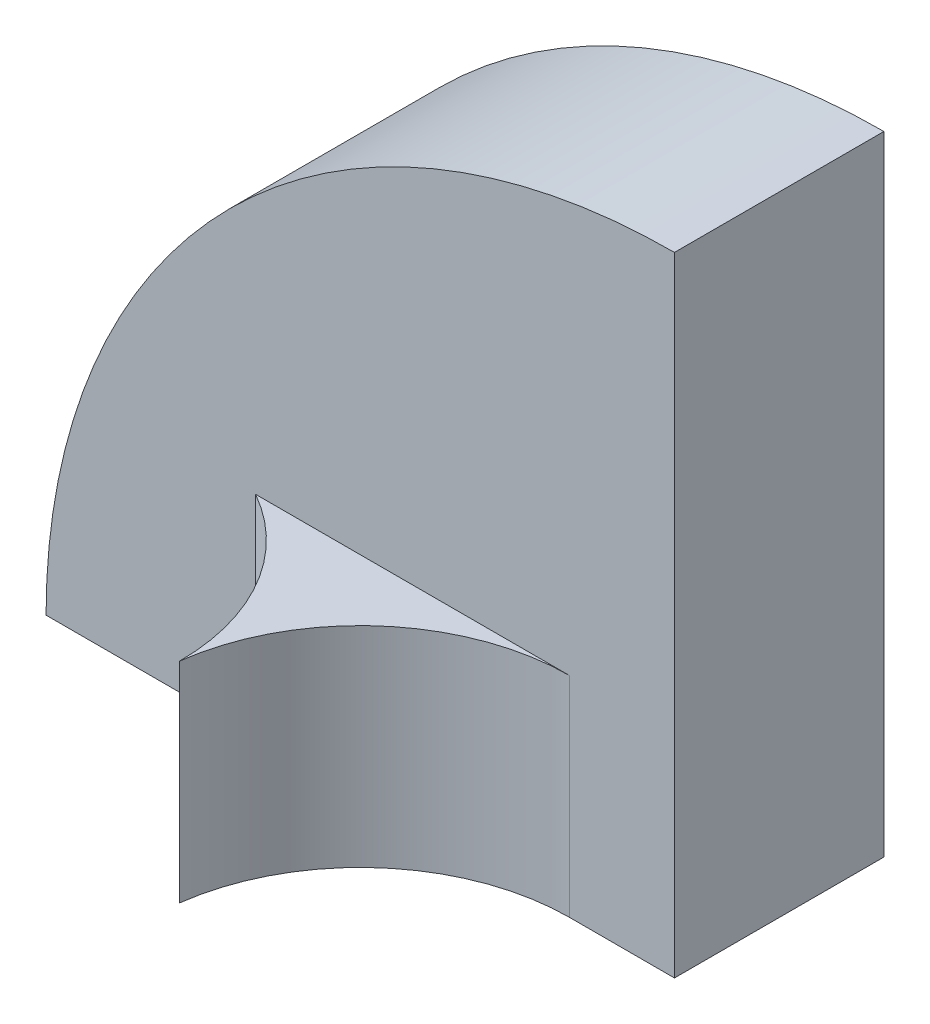
ISO-10303-21;
HEADER;
FILE_DESCRIPTION(('STEP AP214'),'2;1');
FILE_NAME('part.step','',(''),(''),'','','');
FILE_SCHEMA(('AUTOMOTIVE_DESIGN { 1 0 10303 214 1 1 1 1 }'));
ENDSEC;
DATA;
#1=APPLICATION_CONTEXT('core data for automotive mechanical design processes');
#2=APPLICATION_PROTOCOL_DEFINITION('international standard','automotive_design',2000,#1);
#3=PRODUCT_CONTEXT('',#1,'mechanical');
#4=PRODUCT('Part','Part','',(#3));
#5=PRODUCT_RELATED_PRODUCT_CATEGORY('part','',(#4));
#6=PRODUCT_DEFINITION_FORMATION('','',#4);
#7=PRODUCT_DEFINITION_CONTEXT('part definition',#1,'design');
#8=PRODUCT_DEFINITION('design','',#6,#7);
#9=PRODUCT_DEFINITION_SHAPE('','',#8);
#10=(LENGTH_UNIT() NAMED_UNIT(*) SI_UNIT(.MILLI.,.METRE.));
#11=(NAMED_UNIT(*) PLANE_ANGLE_UNIT() SI_UNIT($,.RADIAN.));
#12=(NAMED_UNIT(*) SI_UNIT($,.STERADIAN.) SOLID_ANGLE_UNIT());
#13=UNCERTAINTY_MEASURE_WITH_UNIT(LENGTH_MEASURE(1.E-05),#10,'distance_accuracy_value','');
#14=(GEOMETRIC_REPRESENTATION_CONTEXT(3) GLOBAL_UNCERTAINTY_ASSIGNED_CONTEXT((#13)) GLOBAL_UNIT_ASSIGNED_CONTEXT((#10,
#11,#12)) REPRESENTATION_CONTEXT('',''));
#15=CARTESIAN_POINT('',(0.,0.,0.));
#16=DIRECTION('',(0.,0.,1.));
#17=DIRECTION('',(1.,0.,0.));
#18=AXIS2_PLACEMENT_3D('',#15,#16,#17);
#19=CARTESIAN_POINT('',(0.,0.,2.));
#20=DIRECTION('',(0.,0.,-1.));
#21=DIRECTION('',(-1.,0.,0.));
#22=AXIS2_PLACEMENT_3D('',#19,#20,#21);
#23=PLANE('',#22);
#24=DIRECTION('',(0.,-1.,0.));
#25=VECTOR('',#24,1.);
#26=CARTESIAN_POINT('',(-3.99996614209211,2.,2.));
#27=LINE('',#26,#25);
#28=CARTESIAN_POINT('',(-3.99996614209211,2.,2.));
#29=VERTEX_POINT('',#28);
#30=CARTESIAN_POINT('',(-3.99996614209211,0.,2.));
#31=VERTEX_POINT('',#30);
#32=EDGE_CURVE('E107',#29,#31,#27,.T.);
#33=ORIENTED_EDGE('',*,*,#32,.F.);
#34=DIRECTION('',(-1.,0.,0.));
#35=VECTOR('',#34,1.);
#36=CARTESIAN_POINT('',(0.,2.,2.));
#37=LINE('',#36,#35);
#38=CARTESIAN_POINT('',(-1.00003385790789,2.,2.));
#39=VERTEX_POINT('',#38);
#40=EDGE_CURVE('E108',#39,#29,#37,.T.);
#41=ORIENTED_EDGE('',*,*,#40,.F.);
#42=DIRECTION('',(0.,-1.,0.));
#43=VECTOR('',#42,1.);
#44=CARTESIAN_POINT('',(-1.00003385790789,2.,2.));
#45=LINE('',#44,#43);
#46=CARTESIAN_POINT('',(-1.00003385790789,0.,2.));
#47=VERTEX_POINT('',#46);
#48=EDGE_CURVE('E117',#39,#47,#45,.T.);
#49=ORIENTED_EDGE('',*,*,#48,.T.);
#50=DIRECTION('',(1.,0.,0.));
#51=VECTOR('',#50,1.);
#52=CARTESIAN_POINT('',(0.,0.,2.));
#53=LINE('',#52,#51);
#54=CARTESIAN_POINT('',(0.,0.,2.));
#55=VERTEX_POINT('',#54);
#56=EDGE_CURVE('E82',#47,#55,#53,.T.);
#57=ORIENTED_EDGE('',*,*,#56,.T.);
#58=DIRECTION('',(0.,1.,0.));
#59=VECTOR('',#58,1.);
#60=CARTESIAN_POINT('',(0.,0.,2.));
#61=LINE('',#60,#59);
#62=CARTESIAN_POINT('',(0.,6.,2.));
#63=VERTEX_POINT('',#62);
#64=EDGE_CURVE('E135',#55,#63,#61,.T.);
#65=ORIENTED_EDGE('',*,*,#64,.T.);
#66=CARTESIAN_POINT('',(0.,0.,2.));
#67=DIRECTION('',(0.,0.,1.));
#68=DIRECTION('',(-1.,0.,0.));
#69=AXIS2_PLACEMENT_3D('',#66,#67,#68);
#70=CIRCLE('',#69,6.);
#71=CARTESIAN_POINT('',(-6.,0.,2.));
#72=VERTEX_POINT('',#71);
#73=EDGE_CURVE('E61',#63,#72,#70,.T.);
#74=ORIENTED_EDGE('',*,*,#73,.T.);
#75=EDGE_CURVE('E134',#72,#31,#53,.T.);
#76=ORIENTED_EDGE('',*,*,#75,.T.);
#77=EDGE_LOOP('',(#33,#41,#49,#57,#65,#74,#76));
#78=FACE_BOUND('',#77,.T.);
#79=ADVANCED_FACE('F35',(#78),#23,.F.);
#80=CARTESIAN_POINT('',(0.,0.,2.));
#81=DIRECTION('',(0.,1.,0.));
#82=DIRECTION('',(-1.,0.,0.));
#83=AXIS2_PLACEMENT_3D('',#80,#81,#82);
#84=PLANE('',#83);
#85=DIRECTION('',(1.,0.,0.));
#86=VECTOR('',#85,1.);
#87=CARTESIAN_POINT('',(0.,0.,0.));
#88=LINE('',#87,#86);
#89=CARTESIAN_POINT('',(-6.,0.,0.));
#90=VERTEX_POINT('',#89);
#91=CARTESIAN_POINT('',(0.,0.,0.));
#92=VERTEX_POINT('',#91);
#93=EDGE_CURVE('E126',#90,#92,#88,.T.);
#94=ORIENTED_EDGE('',*,*,#93,.T.);
#95=DIRECTION('',(0.,0.,-1.));
#96=VECTOR('',#95,1.);
#97=CARTESIAN_POINT('',(0.,0.,2.));
#98=LINE('',#97,#96);
#99=EDGE_CURVE('E11',#55,#92,#98,.T.);
#100=ORIENTED_EDGE('',*,*,#99,.F.);
#101=ORIENTED_EDGE('',*,*,#56,.F.);
#102=CARTESIAN_POINT('',(-1.,0.,3.99999999971341));
#103=DIRECTION('',(0.,-1.,0.));
#104=DIRECTION('',(1.,0.,0.));
#105=AXIS2_PLACEMENT_3D('',#102,#103,#104);
#106=CIRCLE('',#105,2.);
#107=CARTESIAN_POINT('',(-2.98323737762175,0.,3.74160204305741));
#108=VERTEX_POINT('',#107);
#109=EDGE_CURVE('E52',#47,#108,#106,.F.);
#110=ORIENTED_EDGE('',*,*,#109,.T.);
#111=CARTESIAN_POINT('',(-4.98323737762175,0.,3.74160204334401));
#112=DIRECTION('',(0.,-1.,0.));
#113=DIRECTION('',(1.,0.,0.));
#114=AXIS2_PLACEMENT_3D('',#111,#112,#113);
#115=CIRCLE('',#114,2.);
#116=EDGE_CURVE('E105',#108,#31,#115,.F.);
#117=ORIENTED_EDGE('',*,*,#116,.T.);
#118=ORIENTED_EDGE('',*,*,#75,.F.);
#119=DIRECTION('',(0.,0.,-1.));
#120=VECTOR('',#119,1.);
#121=CARTESIAN_POINT('',(-6.,0.,2.));
#122=LINE('',#121,#120);
#123=EDGE_CURVE('E144',#72,#90,#122,.T.);
#124=ORIENTED_EDGE('',*,*,#123,.T.);
#125=EDGE_LOOP('',(#94,#100,#101,#110,#117,#118,#124));
#126=FACE_BOUND('',#125,.T.);
#127=ADVANCED_FACE('F37',(#126),#84,.F.);
#128=CARTESIAN_POINT('',(0.,0.,2.));
#129=DIRECTION('',(-1.,0.,0.));
#130=DIRECTION('',(0.,0.,1.));
#131=AXIS2_PLACEMENT_3D('',#128,#129,#130);
#132=PLANE('',#131);
#133=DIRECTION('',(0.,1.,0.));
#134=VECTOR('',#133,1.);
#135=CARTESIAN_POINT('',(0.,0.,0.));
#136=LINE('',#135,#134);
#137=CARTESIAN_POINT('',(0.,6.,0.));
#138=VERTEX_POINT('',#137);
#139=EDGE_CURVE('E146',#92,#138,#136,.T.);
#140=ORIENTED_EDGE('',*,*,#139,.T.);
#141=DIRECTION('',(0.,0.,-1.));
#142=VECTOR('',#141,1.);
#143=CARTESIAN_POINT('',(0.,6.,2.));
#144=LINE('',#143,#142);
#145=EDGE_CURVE('E44',#63,#138,#144,.T.);
#146=ORIENTED_EDGE('',*,*,#145,.F.);
#147=ORIENTED_EDGE('',*,*,#64,.F.);
#148=ORIENTED_EDGE('',*,*,#99,.T.);
#149=EDGE_LOOP('',(#140,#146,#147,#148));
#150=FACE_BOUND('',#149,.T.);
#151=ADVANCED_FACE('F156',(#150),#132,.F.);
#152=CARTESIAN_POINT('',(0.,0.,2.));
#153=DIRECTION('',(0.,0.,-1.));
#154=DIRECTION('',(-1.,0.,0.));
#155=AXIS2_PLACEMENT_3D('',#152,#153,#154);
#156=CYLINDRICAL_SURFACE('',#155,6.);
#157=CARTESIAN_POINT('',(0.,0.,0.));
#158=DIRECTION('',(0.,0.,1.));
#159=DIRECTION('',(-1.,0.,0.));
#160=AXIS2_PLACEMENT_3D('',#157,#158,#159);
#161=CIRCLE('',#160,6.);
#162=EDGE_CURVE('E78',#138,#90,#161,.T.);
#163=ORIENTED_EDGE('',*,*,#162,.T.);
#164=ORIENTED_EDGE('',*,*,#123,.F.);
#165=ORIENTED_EDGE('',*,*,#73,.F.);
#166=ORIENTED_EDGE('',*,*,#145,.T.);
#167=EDGE_LOOP('',(#163,#164,#165,#166));
#168=FACE_BOUND('',#167,.T.);
#169=ADVANCED_FACE('F150',(#168),#156,.T.);
#170=CARTESIAN_POINT('',(0.,0.,0.));
#171=DIRECTION('',(0.,0.,-1.));
#172=DIRECTION('',(-1.,0.,0.));
#173=AXIS2_PLACEMENT_3D('',#170,#171,#172);
#174=PLANE('',#173);
#175=ORIENTED_EDGE('',*,*,#93,.F.);
#176=ORIENTED_EDGE('',*,*,#162,.F.);
#177=ORIENTED_EDGE('',*,*,#139,.F.);
#178=EDGE_LOOP('',(#175,#176,#177));
#179=FACE_BOUND('',#178,.T.);
#180=ADVANCED_FACE('F154',(#179),#174,.T.);
#181=CARTESIAN_POINT('',(-1.,2.,3.99999999971341));
#182=DIRECTION('',(0.,-1.,0.));
#183=DIRECTION('',(1.,0.,0.));
#184=AXIS2_PLACEMENT_3D('',#181,#182,#183);
#185=CYLINDRICAL_SURFACE('',#184,2.);
#186=ORIENTED_EDGE('',*,*,#109,.F.);
#187=ORIENTED_EDGE('',*,*,#48,.F.);
#188=CARTESIAN_POINT('',(-1.,2.,3.99999999971341));
#189=DIRECTION('',(0.,-1.,0.));
#190=DIRECTION('',(1.,0.,0.));
#191=AXIS2_PLACEMENT_3D('',#188,#189,#190);
#192=CIRCLE('',#191,2.);
#193=CARTESIAN_POINT('',(-2.98323737762175,2.,3.74160204305741));
#194=VERTEX_POINT('',#193);
#195=EDGE_CURVE('E113',#39,#194,#192,.F.);
#196=ORIENTED_EDGE('',*,*,#195,.T.);
#197=DIRECTION('',(0.,-1.,0.));
#198=VECTOR('',#197,1.);
#199=CARTESIAN_POINT('',(-2.98323737762175,2.,3.74160204305741));
#200=LINE('',#199,#198);
#201=EDGE_CURVE('E99',#194,#108,#200,.T.);
#202=ORIENTED_EDGE('',*,*,#201,.T.);
#203=EDGE_LOOP('',(#186,#187,#196,#202));
#204=FACE_BOUND('',#203,.T.);
#205=ADVANCED_FACE('F116',(#204),#185,.F.);
#206=CARTESIAN_POINT('',(-4.98323737762175,2.,3.74160204334401));
#207=DIRECTION('',(0.,-1.,0.));
#208=DIRECTION('',(1.,0.,0.));
#209=AXIS2_PLACEMENT_3D('',#206,#207,#208);
#210=CYLINDRICAL_SURFACE('',#209,2.);
#211=ORIENTED_EDGE('',*,*,#116,.F.);
#212=ORIENTED_EDGE('',*,*,#201,.F.);
#213=CARTESIAN_POINT('',(-4.98323737762175,2.,3.74160204334401));
#214=DIRECTION('',(0.,-1.,0.));
#215=DIRECTION('',(1.,0.,0.));
#216=AXIS2_PLACEMENT_3D('',#213,#214,#215);
#217=CIRCLE('',#216,2.);
#218=EDGE_CURVE('E102',#194,#29,#217,.F.);
#219=ORIENTED_EDGE('',*,*,#218,.T.);
#220=ORIENTED_EDGE('',*,*,#32,.T.);
#221=EDGE_LOOP('',(#211,#212,#219,#220));
#222=FACE_BOUND('',#221,.T.);
#223=ADVANCED_FACE('F101',(#222),#210,.F.);
#224=CARTESIAN_POINT('',(0.,2.,0.));
#225=DIRECTION('',(0.,-1.,0.));
#226=DIRECTION('',(1.,0.,0.));
#227=AXIS2_PLACEMENT_3D('',#224,#225,#226);
#228=PLANE('',#227);
#229=ORIENTED_EDGE('',*,*,#195,.F.);
#230=ORIENTED_EDGE('',*,*,#40,.T.);
#231=ORIENTED_EDGE('',*,*,#218,.F.);
#232=EDGE_LOOP('',(#229,#230,#231));
#233=FACE_BOUND('',#232,.T.);
#234=ADVANCED_FACE('F112',(#233),#228,.F.);
#235=CLOSED_SHELL('',(#79,#127,#151,#169,#180,#205,#223,#234));
#236=MANIFOLD_SOLID_BREP('B2',#235);
#237=ADVANCED_BREP_SHAPE_REPRESENTATION('',(#18,#236),#14);
#238=SHAPE_DEFINITION_REPRESENTATION(#9,#237);
ENDSEC;
END-ISO-10303-21;
